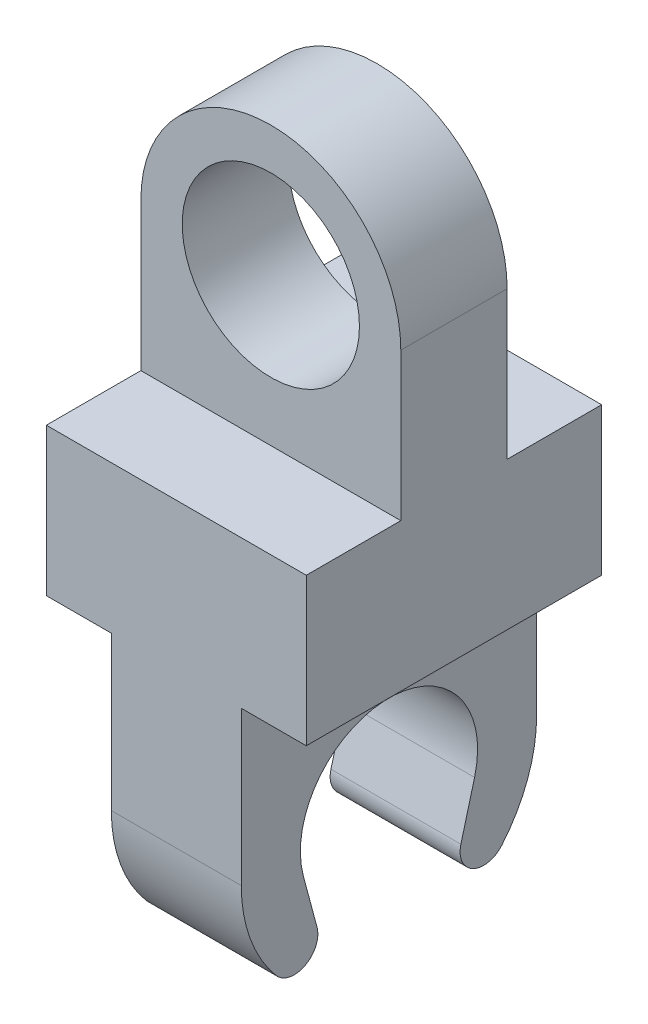
ISO-10303-21;
HEADER;
FILE_DESCRIPTION(('STEP AP214'),'2;1');
FILE_NAME('part.step','',(''),(''),'','','');
FILE_SCHEMA(('AUTOMOTIVE_DESIGN { 1 0 10303 214 1 1 1 1 }'));
ENDSEC;
DATA;
#1=APPLICATION_CONTEXT('core data for automotive mechanical design processes');
#2=APPLICATION_PROTOCOL_DEFINITION('international standard','automotive_design',2000,#1);
#3=PRODUCT_CONTEXT('',#1,'mechanical');
#4=PRODUCT('Part','Part','',(#3));
#5=PRODUCT_RELATED_PRODUCT_CATEGORY('part','',(#4));
#6=PRODUCT_DEFINITION_FORMATION('','',#4);
#7=PRODUCT_DEFINITION_CONTEXT('part definition',#1,'design');
#8=PRODUCT_DEFINITION('design','',#6,#7);
#9=PRODUCT_DEFINITION_SHAPE('','',#8);
#10=(LENGTH_UNIT() NAMED_UNIT(*) SI_UNIT(.MILLI.,.METRE.));
#11=(NAMED_UNIT(*) PLANE_ANGLE_UNIT() SI_UNIT($,.RADIAN.));
#12=(NAMED_UNIT(*) SI_UNIT($,.STERADIAN.) SOLID_ANGLE_UNIT());
#13=UNCERTAINTY_MEASURE_WITH_UNIT(LENGTH_MEASURE(1.E-05),#10,'distance_accuracy_value','');
#14=(GEOMETRIC_REPRESENTATION_CONTEXT(3) GLOBAL_UNCERTAINTY_ASSIGNED_CONTEXT((#13)) GLOBAL_UNIT_ASSIGNED_CONTEXT((#10,
#11,#12)) REPRESENTATION_CONTEXT('',''));
#15=CARTESIAN_POINT('',(0.,0.,0.));
#16=DIRECTION('',(0.,0.,1.));
#17=DIRECTION('',(1.,0.,0.));
#18=AXIS2_PLACEMENT_3D('',#15,#16,#17);
#19=CARTESIAN_POINT('',(22.,-25.,0.));
#20=DIRECTION('',(0.,1.,0.));
#21=DIRECTION('',(0.,0.,1.));
#22=AXIS2_PLACEMENT_3D('',#19,#20,#21);
#23=PLANE('',#22);
#24=DIRECTION('',(0.,0.,1.));
#25=VECTOR('',#24,1.);
#26=CARTESIAN_POINT('',(11.,-25.,25.));
#27=LINE('',#26,#25);
#28=CARTESIAN_POINT('',(11.,-25.,-25.));
#29=VERTEX_POINT('',#28);
#30=CARTESIAN_POINT('',(11.,-25.,25.));
#31=VERTEX_POINT('',#30);
#32=EDGE_CURVE('E234',#29,#31,#27,.T.);
#33=ORIENTED_EDGE('',*,*,#32,.F.);
#34=DIRECTION('',(-1.,0.,0.));
#35=VECTOR('',#34,1.);
#36=CARTESIAN_POINT('',(22.,-25.,-25.));
#37=LINE('',#36,#35);
#38=CARTESIAN_POINT('',(22.,-25.,-25.));
#39=VERTEX_POINT('',#38);
#40=EDGE_CURVE('E219',#39,#29,#37,.T.);
#41=ORIENTED_EDGE('',*,*,#40,.F.);
#42=DIRECTION('',(0.,0.,-1.));
#43=VECTOR('',#42,1.);
#44=CARTESIAN_POINT('',(22.,-25.,0.));
#45=LINE('',#44,#43);
#46=CARTESIAN_POINT('',(22.,-25.,25.));
#47=VERTEX_POINT('',#46);
#48=EDGE_CURVE('E278',#47,#39,#45,.T.);
#49=ORIENTED_EDGE('',*,*,#48,.F.);
#50=DIRECTION('',(-1.,0.,0.));
#51=VECTOR('',#50,1.);
#52=CARTESIAN_POINT('',(22.,-25.,25.));
#53=LINE('',#52,#51);
#54=EDGE_CURVE('E286',#47,#31,#53,.T.);
#55=ORIENTED_EDGE('',*,*,#54,.T.);
#56=EDGE_LOOP('',(#33,#41,#49,#55));
#57=FACE_BOUND('',#56,.T.);
#58=ADVANCED_FACE('F45',(#57),#23,.F.);
#59=CARTESIAN_POINT('',(22.,0.,9.));
#60=DIRECTION('',(-1.,0.,0.));
#61=DIRECTION('',(0.,0.,1.));
#62=AXIS2_PLACEMENT_3D('',#59,#60,#61);
#63=PLANE('',#62);
#64=ORIENTED_EDGE('',*,*,#48,.T.);
#65=DIRECTION('',(0.,-1.,0.));
#66=VECTOR('',#65,1.);
#67=CARTESIAN_POINT('',(22.,0.,-25.));
#68=LINE('',#67,#66);
#69=CARTESIAN_POINT('',(22.,0.,-25.));
#70=VERTEX_POINT('',#69);
#71=EDGE_CURVE('E208',#70,#39,#68,.T.);
#72=ORIENTED_EDGE('',*,*,#71,.F.);
#73=DIRECTION('',(0.,0.,-1.));
#74=VECTOR('',#73,1.);
#75=CARTESIAN_POINT('',(22.,0.,0.));
#76=LINE('',#75,#74);
#77=CARTESIAN_POINT('',(22.,0.,-9.));
#78=VERTEX_POINT('',#77);
#79=EDGE_CURVE('E205',#78,#70,#76,.T.);
#80=ORIENTED_EDGE('',*,*,#79,.F.);
#81=DIRECTION('',(0.,1.,0.));
#82=VECTOR('',#81,1.);
#83=CARTESIAN_POINT('',(22.,0.,-9.));
#84=LINE('',#83,#82);
#85=CARTESIAN_POINT('',(22.,25.,-9.));
#86=VERTEX_POINT('',#85);
#87=EDGE_CURVE('E225',#78,#86,#84,.T.);
#88=ORIENTED_EDGE('',*,*,#87,.T.);
#89=DIRECTION('',(0.,0.,-1.));
#90=VECTOR('',#89,1.);
#91=CARTESIAN_POINT('',(22.,25.,9.));
#92=LINE('',#91,#90);
#93=CARTESIAN_POINT('',(22.,25.,9.));
#94=VERTEX_POINT('',#93);
#95=EDGE_CURVE('E11',#94,#86,#92,.T.);
#96=ORIENTED_EDGE('',*,*,#95,.F.);
#97=DIRECTION('',(0.,1.,0.));
#98=VECTOR('',#97,1.);
#99=CARTESIAN_POINT('',(22.,0.,9.));
#100=LINE('',#99,#98);
#101=CARTESIAN_POINT('',(22.,0.,9.));
#102=VERTEX_POINT('',#101);
#103=EDGE_CURVE('E295',#102,#94,#100,.T.);
#104=ORIENTED_EDGE('',*,*,#103,.F.);
#105=DIRECTION('',(0.,0.,1.));
#106=VECTOR('',#105,1.);
#107=CARTESIAN_POINT('',(22.,0.,0.));
#108=LINE('',#107,#106);
#109=CARTESIAN_POINT('',(22.,0.,25.));
#110=VERTEX_POINT('',#109);
#111=EDGE_CURVE('E273',#102,#110,#108,.T.);
#112=ORIENTED_EDGE('',*,*,#111,.T.);
#113=DIRECTION('',(0.,-1.,0.));
#114=VECTOR('',#113,1.);
#115=CARTESIAN_POINT('',(22.,0.,25.));
#116=LINE('',#115,#114);
#117=EDGE_CURVE('E275',#110,#47,#116,.T.);
#118=ORIENTED_EDGE('',*,*,#117,.T.);
#119=EDGE_LOOP('',(#64,#72,#80,#88,#96,#104,#112,#118));
#120=FACE_BOUND('',#119,.T.);
#121=ADVANCED_FACE('F47',(#120),#63,.F.);
#122=CARTESIAN_POINT('',(0.,25.,9.));
#123=DIRECTION('',(0.,0.,-1.));
#124=DIRECTION('',(-1.,0.,0.));
#125=AXIS2_PLACEMENT_3D('',#122,#123,#124);
#126=CYLINDRICAL_SURFACE('',#125,22.);
#127=ORIENTED_EDGE('',*,*,#95,.T.);
#128=CARTESIAN_POINT('',(0.,25.,-9.));
#129=DIRECTION('',(0.,0.,1.));
#130=DIRECTION('',(1.,0.,0.));
#131=AXIS2_PLACEMENT_3D('',#128,#129,#130);
#132=CIRCLE('',#131,22.);
#133=CARTESIAN_POINT('',(-22.,25.,-9.));
#134=VERTEX_POINT('',#133);
#135=EDGE_CURVE('E228',#86,#134,#132,.T.);
#136=ORIENTED_EDGE('',*,*,#135,.T.);
#137=DIRECTION('',(0.,0.,-1.));
#138=VECTOR('',#137,1.);
#139=CARTESIAN_POINT('',(-22.,25.,9.));
#140=LINE('',#139,#138);
#141=CARTESIAN_POINT('',(-22.,25.,9.));
#142=VERTEX_POINT('',#141);
#143=EDGE_CURVE('E54',#142,#134,#140,.T.);
#144=ORIENTED_EDGE('',*,*,#143,.F.);
#145=CARTESIAN_POINT('',(0.,25.,9.));
#146=DIRECTION('',(0.,0.,1.));
#147=DIRECTION('',(1.,0.,0.));
#148=AXIS2_PLACEMENT_3D('',#145,#146,#147);
#149=CIRCLE('',#148,22.);
#150=EDGE_CURVE('E69',#94,#142,#149,.T.);
#151=ORIENTED_EDGE('',*,*,#150,.F.);
#152=EDGE_LOOP('',(#127,#136,#144,#151));
#153=FACE_BOUND('',#152,.T.);
#154=ADVANCED_FACE('F311',(#153),#126,.T.);
#155=CARTESIAN_POINT('',(-22.,0.,9.));
#156=DIRECTION('',(1.,0.,0.));
#157=DIRECTION('',(0.,0.,-1.));
#158=AXIS2_PLACEMENT_3D('',#155,#156,#157);
#159=PLANE('',#158);
#160=ORIENTED_EDGE('',*,*,#143,.T.);
#161=DIRECTION('',(0.,-1.,0.));
#162=VECTOR('',#161,1.);
#163=CARTESIAN_POINT('',(-22.,0.,-9.));
#164=LINE('',#163,#162);
#165=CARTESIAN_POINT('',(-22.,0.,-9.));
#166=VERTEX_POINT('',#165);
#167=EDGE_CURVE('E231',#134,#166,#164,.T.);
#168=ORIENTED_EDGE('',*,*,#167,.T.);
#169=DIRECTION('',(0.,0.,-1.));
#170=VECTOR('',#169,1.);
#171=CARTESIAN_POINT('',(-22.,0.,0.));
#172=LINE('',#171,#170);
#173=CARTESIAN_POINT('',(-22.,0.,-25.));
#174=VERTEX_POINT('',#173);
#175=EDGE_CURVE('E213',#166,#174,#172,.T.);
#176=ORIENTED_EDGE('',*,*,#175,.T.);
#177=DIRECTION('',(0.,-1.,0.));
#178=VECTOR('',#177,1.);
#179=CARTESIAN_POINT('',(-22.,0.,-25.));
#180=LINE('',#179,#178);
#181=CARTESIAN_POINT('',(-22.,-25.,-25.));
#182=VERTEX_POINT('',#181);
#183=EDGE_CURVE('E209',#174,#182,#180,.T.);
#184=ORIENTED_EDGE('',*,*,#183,.T.);
#185=DIRECTION('',(0.,0.,-1.));
#186=VECTOR('',#185,1.);
#187=CARTESIAN_POINT('',(-22.,-25.,0.));
#188=LINE('',#187,#186);
#189=CARTESIAN_POINT('',(-22.,-25.,25.));
#190=VERTEX_POINT('',#189);
#191=EDGE_CURVE('E276',#190,#182,#188,.T.);
#192=ORIENTED_EDGE('',*,*,#191,.F.);
#193=DIRECTION('',(0.,-1.,0.));
#194=VECTOR('',#193,1.);
#195=CARTESIAN_POINT('',(-22.,0.,25.));
#196=LINE('',#195,#194);
#197=CARTESIAN_POINT('',(-22.,0.,25.));
#198=VERTEX_POINT('',#197);
#199=EDGE_CURVE('E282',#198,#190,#196,.T.);
#200=ORIENTED_EDGE('',*,*,#199,.F.);
#201=DIRECTION('',(0.,0.,1.));
#202=VECTOR('',#201,1.);
#203=CARTESIAN_POINT('',(-22.,0.,0.));
#204=LINE('',#203,#202);
#205=CARTESIAN_POINT('',(-22.,0.,9.));
#206=VERTEX_POINT('',#205);
#207=EDGE_CURVE('E267',#206,#198,#204,.T.);
#208=ORIENTED_EDGE('',*,*,#207,.F.);
#209=DIRECTION('',(0.,-1.,0.));
#210=VECTOR('',#209,1.);
#211=CARTESIAN_POINT('',(-22.,0.,9.));
#212=LINE('',#211,#210);
#213=EDGE_CURVE('E298',#142,#206,#212,.T.);
#214=ORIENTED_EDGE('',*,*,#213,.F.);
#215=EDGE_LOOP('',(#160,#168,#176,#184,#192,#200,#208,#214));
#216=FACE_BOUND('',#215,.T.);
#217=ADVANCED_FACE('F303',(#216),#159,.F.);
#218=CARTESIAN_POINT('',(0.,25.,9.));
#219=DIRECTION('',(0.,0.,1.));
#220=DIRECTION('',(1.,0.,0.));
#221=AXIS2_PLACEMENT_3D('',#218,#219,#220);
#222=PLANE('',#221);
#223=CARTESIAN_POINT('',(0.,25.,9.));
#224=DIRECTION('',(0.,0.,1.));
#225=DIRECTION('',(1.,0.,0.));
#226=AXIS2_PLACEMENT_3D('',#223,#224,#225);
#227=CIRCLE('',#226,15.);
#228=CARTESIAN_POINT('',(15.,25.,9.));
#229=VERTEX_POINT('',#228);
#230=EDGE_CURVE('E343',#229,#229,#227,.T.);
#231=ORIENTED_EDGE('',*,*,#230,.F.);
#232=EDGE_LOOP('',(#231));
#233=FACE_BOUND('',#232,.T.);
#234=ORIENTED_EDGE('',*,*,#103,.T.);
#235=ORIENTED_EDGE('',*,*,#150,.T.);
#236=ORIENTED_EDGE('',*,*,#213,.T.);
#237=DIRECTION('',(1.,0.,0.));
#238=VECTOR('',#237,1.);
#239=CARTESIAN_POINT('',(-22.,0.,9.));
#240=LINE('',#239,#238);
#241=EDGE_CURVE('E292',#206,#102,#240,.T.);
#242=ORIENTED_EDGE('',*,*,#241,.T.);
#243=EDGE_LOOP('',(#234,#235,#236,#242));
#244=FACE_BOUND('',#243,.T.);
#245=ADVANCED_FACE('F329',(#233,#244),#222,.T.);
#246=CARTESIAN_POINT('',(22.,0.,0.));
#247=DIRECTION('',(0.,-1.,0.));
#248=DIRECTION('',(0.,0.,-1.));
#249=AXIS2_PLACEMENT_3D('',#246,#247,#248);
#250=PLANE('',#249);
#251=ORIENTED_EDGE('',*,*,#207,.T.);
#252=DIRECTION('',(-1.,0.,0.));
#253=VECTOR('',#252,1.);
#254=CARTESIAN_POINT('',(22.,0.,25.));
#255=LINE('',#254,#253);
#256=EDGE_CURVE('E289',#110,#198,#255,.T.);
#257=ORIENTED_EDGE('',*,*,#256,.F.);
#258=ORIENTED_EDGE('',*,*,#111,.F.);
#259=ORIENTED_EDGE('',*,*,#241,.F.);
#260=EDGE_LOOP('',(#251,#257,#258,#259));
#261=FACE_BOUND('',#260,.T.);
#262=ADVANCED_FACE('F330',(#261),#250,.F.);
#263=CARTESIAN_POINT('',(22.,0.,25.));
#264=DIRECTION('',(0.,0.,-1.));
#265=DIRECTION('',(0.,1.,0.));
#266=AXIS2_PLACEMENT_3D('',#263,#264,#265);
#267=PLANE('',#266);
#268=ORIENTED_EDGE('',*,*,#199,.T.);
#269=CARTESIAN_POINT('',(-11.,-25.,25.));
#270=VERTEX_POINT('',#269);
#271=EDGE_CURVE('E280',#270,#190,#53,.T.);
#272=ORIENTED_EDGE('',*,*,#271,.F.);
#273=DIRECTION('',(0.,-1.,0.));
#274=VECTOR('',#273,1.);
#275=CARTESIAN_POINT('',(-11.,-25.,25.));
#276=LINE('',#275,#274);
#277=CARTESIAN_POINT('',(-11.,-51.,25.));
#278=VERTEX_POINT('',#277);
#279=EDGE_CURVE('E61',#270,#278,#276,.T.);
#280=ORIENTED_EDGE('',*,*,#279,.T.);
#281=DIRECTION('',(1.,0.,0.));
#282=VECTOR('',#281,1.);
#283=CARTESIAN_POINT('',(-11.,-51.,25.));
#284=LINE('',#283,#282);
#285=CARTESIAN_POINT('',(11.,-51.,25.));
#286=VERTEX_POINT('',#285);
#287=EDGE_CURVE('E249',#278,#286,#284,.T.);
#288=ORIENTED_EDGE('',*,*,#287,.T.);
#289=DIRECTION('',(0.,-1.,0.));
#290=VECTOR('',#289,1.);
#291=CARTESIAN_POINT('',(11.,-25.,25.));
#292=LINE('',#291,#290);
#293=EDGE_CURVE('E252',#31,#286,#292,.T.);
#294=ORIENTED_EDGE('',*,*,#293,.F.);
#295=ORIENTED_EDGE('',*,*,#54,.F.);
#296=ORIENTED_EDGE('',*,*,#117,.F.);
#297=ORIENTED_EDGE('',*,*,#256,.T.);
#298=EDGE_LOOP('',(#268,#272,#280,#288,#294,#295,#296,#297));
#299=FACE_BOUND('',#298,.T.);
#300=ADVANCED_FACE('F325',(#299),#267,.F.);
#301=ORIENTED_EDGE('',*,*,#191,.T.);
#302=CARTESIAN_POINT('',(-11.,-25.,-25.));
#303=VERTEX_POINT('',#302);
#304=EDGE_CURVE('E212',#303,#182,#37,.T.);
#305=ORIENTED_EDGE('',*,*,#304,.F.);
#306=DIRECTION('',(0.,0.,1.));
#307=VECTOR('',#306,1.);
#308=CARTESIAN_POINT('',(-11.,-25.,25.));
#309=LINE('',#308,#307);
#310=EDGE_CURVE('E186',#303,#270,#309,.T.);
#311=ORIENTED_EDGE('',*,*,#310,.T.);
#312=ORIENTED_EDGE('',*,*,#271,.T.);
#313=EDGE_LOOP('',(#301,#305,#311,#312));
#314=FACE_BOUND('',#313,.T.);
#315=ADVANCED_FACE('F322',(#314),#23,.F.);
#316=CARTESIAN_POINT('',(-11.,-51.,0.));
#317=DIRECTION('',(1.,0.,0.));
#318=DIRECTION('',(0.,0.,-1.));
#319=AXIS2_PLACEMENT_3D('',#316,#317,#318);
#320=CYLINDRICAL_SURFACE('',#319,15.);
#321=CARTESIAN_POINT('',(11.,-51.,0.));
#322=DIRECTION('',(-1.,0.,0.));
#323=DIRECTION('',(0.,0.,1.));
#324=AXIS2_PLACEMENT_3D('',#321,#322,#323);
#325=CIRCLE('',#324,15.);
#326=CARTESIAN_POINT('',(11.,-54.8822856765378,14.488887394336));
#327=VERTEX_POINT('',#326);
#328=CARTESIAN_POINT('',(11.,-54.8822856765378,-14.488887394336));
#329=VERTEX_POINT('',#328);
#330=EDGE_CURVE('E236',#327,#329,#325,.T.);
#331=ORIENTED_EDGE('',*,*,#330,.F.);
#332=DIRECTION('',(1.,0.,0.));
#333=VECTOR('',#332,1.);
#334=CARTESIAN_POINT('',(-11.,-54.8822856765378,14.488887394336));
#335=LINE('',#334,#333);
#336=CARTESIAN_POINT('',(-11.,-54.8822856765378,14.488887394336));
#337=VERTEX_POINT('',#336);
#338=EDGE_CURVE('E265',#337,#327,#335,.T.);
#339=ORIENTED_EDGE('',*,*,#338,.F.);
#340=CARTESIAN_POINT('',(-11.,-51.,0.));
#341=DIRECTION('',(-1.,0.,0.));
#342=DIRECTION('',(0.,0.,1.));
#343=AXIS2_PLACEMENT_3D('',#340,#341,#342);
#344=CIRCLE('',#343,15.);
#345=CARTESIAN_POINT('',(-11.,-54.8822856765378,-14.488887394336));
#346=VERTEX_POINT('',#345);
#347=EDGE_CURVE('E247',#337,#346,#344,.T.);
#348=ORIENTED_EDGE('',*,*,#347,.T.);
#349=DIRECTION('',(1.,0.,0.));
#350=VECTOR('',#349,1.);
#351=CARTESIAN_POINT('',(-11.,-54.8822856765378,-14.488887394336));
#352=LINE('',#351,#350);
#353=EDGE_CURVE('E216',#346,#329,#352,.T.);
#354=ORIENTED_EDGE('',*,*,#353,.T.);
#355=EDGE_LOOP('',(#331,#339,#348,#354));
#356=FACE_BOUND('',#355,.T.);
#357=ADVANCED_FACE('F361',(#356),#320,.F.);
#358=CARTESIAN_POINT('',(-11.,-54.8822856765378,14.488887394336));
#359=DIRECTION('',(0.,0.258819045102521,-0.965925826289068));
#360=DIRECTION('',(0.,0.965925826289068,0.258819045102521));
#361=AXIS2_PLACEMENT_3D('',#358,#359,#360);
#362=PLANE('',#361);
#363=DIRECTION('',(0.,0.965925826289068,0.258819045102521));
#364=VECTOR('',#363,1.);
#365=CARTESIAN_POINT('',(11.,-54.8822856765378,14.488887394336));
#366=LINE('',#365,#364);
#367=CARTESIAN_POINT('',(11.,-63.5217889117579,12.1739394794527));
#368=VERTEX_POINT('',#367);
#369=EDGE_CURVE('E261',#368,#327,#366,.T.);
#370=ORIENTED_EDGE('',*,*,#369,.F.);
#371=DIRECTION('',(1.,0.,0.));
#372=VECTOR('',#371,1.);
#373=CARTESIAN_POINT('',(-11.,-63.5217889117579,12.1739394794527));
#374=LINE('',#373,#372);
#375=CARTESIAN_POINT('',(-11.,-63.5217889117579,12.1739394794527));
#376=VERTEX_POINT('',#375);
#377=EDGE_CURVE('E268',#376,#368,#374,.T.);
#378=ORIENTED_EDGE('',*,*,#377,.F.);
#379=DIRECTION('',(0.,0.965925826289068,0.258819045102521));
#380=VECTOR('',#379,1.);
#381=CARTESIAN_POINT('',(-11.,-54.8822856765378,14.488887394336));
#382=LINE('',#381,#380);
#383=EDGE_CURVE('E244',#376,#337,#382,.T.);
#384=ORIENTED_EDGE('',*,*,#383,.T.);
#385=ORIENTED_EDGE('',*,*,#338,.T.);
#386=EDGE_LOOP('',(#370,#378,#384,#385));
#387=FACE_BOUND('',#386,.T.);
#388=ADVANCED_FACE('F392',(#387),#362,.T.);
#389=CARTESIAN_POINT('',(-11.,-64.5570650921679,16.037642784609));
#390=DIRECTION('',(1.,0.,0.));
#391=DIRECTION('',(0.,0.,-1.));
#392=AXIS2_PLACEMENT_3D('',#389,#390,#391);
#393=CYLINDRICAL_SURFACE('',#392,4.);
#394=CARTESIAN_POINT('',(11.,-64.5570650921679,16.037642784609));
#395=DIRECTION('',(1.,0.,0.));
#396=DIRECTION('',(0.,0.,1.));
#397=AXIS2_PLACEMENT_3D('',#394,#395,#396);
#398=CIRCLE('',#397,4.);
#399=CARTESIAN_POINT('',(11.,-67.1393632049618,19.0924318864393));
#400=VERTEX_POINT('',#399);
#401=EDGE_CURVE('E258',#400,#368,#398,.T.);
#402=ORIENTED_EDGE('',*,*,#401,.F.);
#403=DIRECTION('',(1.,0.,0.));
#404=VECTOR('',#403,1.);
#405=CARTESIAN_POINT('',(-11.,-67.1393632049618,19.0924318864393));
#406=LINE('',#405,#404);
#407=CARTESIAN_POINT('',(-11.,-67.1393632049618,19.0924318864393));
#408=VERTEX_POINT('',#407);
#409=EDGE_CURVE('E270',#408,#400,#406,.T.);
#410=ORIENTED_EDGE('',*,*,#409,.F.);
#411=CARTESIAN_POINT('',(-11.,-64.5570650921679,16.037642784609));
#412=DIRECTION('',(1.,0.,0.));
#413=DIRECTION('',(0.,0.,1.));
#414=AXIS2_PLACEMENT_3D('',#411,#412,#413);
#415=CIRCLE('',#414,4.);
#416=EDGE_CURVE('E241',#408,#376,#415,.T.);
#417=ORIENTED_EDGE('',*,*,#416,.T.);
#418=ORIENTED_EDGE('',*,*,#377,.T.);
#419=EDGE_LOOP('',(#402,#410,#417,#418));
#420=FACE_BOUND('',#419,.T.);
#421=ADVANCED_FACE('F418',(#420),#393,.T.);
#422=CARTESIAN_POINT('',(-11.,-51.,0.));
#423=DIRECTION('',(1.,0.,0.));
#424=DIRECTION('',(0.,0.,-1.));
#425=AXIS2_PLACEMENT_3D('',#422,#423,#424);
#426=CYLINDRICAL_SURFACE('',#425,25.);
#427=CARTESIAN_POINT('',(11.,-51.,0.));
#428=DIRECTION('',(1.,0.,0.));
#429=DIRECTION('',(0.,0.,-1.));
#430=AXIS2_PLACEMENT_3D('',#427,#428,#429);
#431=CIRCLE('',#430,25.);
#432=EDGE_CURVE('E255',#286,#400,#431,.T.);
#433=ORIENTED_EDGE('',*,*,#432,.F.);
#434=ORIENTED_EDGE('',*,*,#287,.F.);
#435=CARTESIAN_POINT('',(-11.,-51.,0.));
#436=DIRECTION('',(1.,0.,0.));
#437=DIRECTION('',(0.,0.,-1.));
#438=AXIS2_PLACEMENT_3D('',#435,#436,#437);
#439=CIRCLE('',#438,25.);
#440=EDGE_CURVE('E238',#278,#408,#439,.T.);
#441=ORIENTED_EDGE('',*,*,#440,.T.);
#442=ORIENTED_EDGE('',*,*,#409,.T.);
#443=EDGE_LOOP('',(#433,#434,#441,#442));
#444=FACE_BOUND('',#443,.T.);
#445=ADVANCED_FACE('F427',(#444),#426,.T.);
#446=CARTESIAN_POINT('',(-11.,-51.,0.));
#447=DIRECTION('',(-1.,0.,0.));
#448=DIRECTION('',(0.,0.,1.));
#449=AXIS2_PLACEMENT_3D('',#446,#447,#448);
#450=PLANE('',#449);
#451=ORIENTED_EDGE('',*,*,#310,.F.);
#452=DIRECTION('',(0.,-1.,0.));
#453=VECTOR('',#452,1.);
#454=CARTESIAN_POINT('',(-11.,-25.,-25.));
#455=LINE('',#454,#453);
#456=CARTESIAN_POINT('',(-11.,-51.,-25.));
#457=VERTEX_POINT('',#456);
#458=EDGE_CURVE('E182',#303,#457,#455,.T.);
#459=ORIENTED_EDGE('',*,*,#458,.T.);
#460=CARTESIAN_POINT('',(-11.,-51.,0.));
#461=DIRECTION('',(-1.,0.,0.));
#462=DIRECTION('',(0.,0.,1.));
#463=AXIS2_PLACEMENT_3D('',#460,#461,#462);
#464=CIRCLE('',#463,25.);
#465=CARTESIAN_POINT('',(-11.,-67.1393632049618,-19.0924318864393));
#466=VERTEX_POINT('',#465);
#467=EDGE_CURVE('E172',#457,#466,#464,.T.);
#468=ORIENTED_EDGE('',*,*,#467,.T.);
#469=CARTESIAN_POINT('',(-11.,-64.5570650921679,-16.037642784609));
#470=DIRECTION('',(-1.,0.,0.));
#471=DIRECTION('',(0.,0.,-1.));
#472=AXIS2_PLACEMENT_3D('',#469,#470,#471);
#473=CIRCLE('',#472,4.);
#474=CARTESIAN_POINT('',(-11.,-63.5217889117579,-12.1739394794527));
#475=VERTEX_POINT('',#474);
#476=EDGE_CURVE('E181',#466,#475,#473,.T.);
#477=ORIENTED_EDGE('',*,*,#476,.T.);
#478=DIRECTION('',(0.,0.965925826289068,-0.258819045102521));
#479=VECTOR('',#478,1.);
#480=CARTESIAN_POINT('',(-11.,-54.8822856765378,-14.488887394336));
#481=LINE('',#480,#479);
#482=EDGE_CURVE('E197',#475,#346,#481,.T.);
#483=ORIENTED_EDGE('',*,*,#482,.T.);
#484=ORIENTED_EDGE('',*,*,#347,.F.);
#485=ORIENTED_EDGE('',*,*,#383,.F.);
#486=ORIENTED_EDGE('',*,*,#416,.F.);
#487=ORIENTED_EDGE('',*,*,#440,.F.);
#488=ORIENTED_EDGE('',*,*,#279,.F.);
#489=EDGE_LOOP('',(#451,#459,#468,#477,#483,#484,#485,#486,#487,#488));
#490=FACE_BOUND('',#489,.T.);
#491=ADVANCED_FACE('F185',(#490),#450,.T.);
#492=CARTESIAN_POINT('',(11.,-51.,0.));
#493=DIRECTION('',(-1.,0.,0.));
#494=DIRECTION('',(0.,0.,1.));
#495=AXIS2_PLACEMENT_3D('',#492,#493,#494);
#496=PLANE('',#495);
#497=ORIENTED_EDGE('',*,*,#32,.T.);
#498=ORIENTED_EDGE('',*,*,#293,.T.);
#499=ORIENTED_EDGE('',*,*,#432,.T.);
#500=ORIENTED_EDGE('',*,*,#401,.T.);
#501=ORIENTED_EDGE('',*,*,#369,.T.);
#502=ORIENTED_EDGE('',*,*,#330,.T.);
#503=DIRECTION('',(0.,0.965925826289068,-0.258819045102521));
#504=VECTOR('',#503,1.);
#505=CARTESIAN_POINT('',(11.,-54.8822856765378,-14.488887394336));
#506=LINE('',#505,#504);
#507=CARTESIAN_POINT('',(11.,-63.5217889117579,-12.1739394794527));
#508=VERTEX_POINT('',#507);
#509=EDGE_CURVE('E190',#508,#329,#506,.T.);
#510=ORIENTED_EDGE('',*,*,#509,.F.);
#511=CARTESIAN_POINT('',(11.,-64.5570650921679,-16.037642784609));
#512=DIRECTION('',(-1.,0.,0.));
#513=DIRECTION('',(0.,0.,-1.));
#514=AXIS2_PLACEMENT_3D('',#511,#512,#513);
#515=CIRCLE('',#514,4.);
#516=CARTESIAN_POINT('',(11.,-67.1393632049618,-19.0924318864393));
#517=VERTEX_POINT('',#516);
#518=EDGE_CURVE('E340',#517,#508,#515,.T.);
#519=ORIENTED_EDGE('',*,*,#518,.F.);
#520=CARTESIAN_POINT('',(11.,-51.,0.));
#521=DIRECTION('',(-1.,0.,0.));
#522=DIRECTION('',(0.,0.,1.));
#523=AXIS2_PLACEMENT_3D('',#520,#521,#522);
#524=CIRCLE('',#523,25.);
#525=CARTESIAN_POINT('',(11.,-51.,-25.));
#526=VERTEX_POINT('',#525);
#527=EDGE_CURVE('E338',#526,#517,#524,.T.);
#528=ORIENTED_EDGE('',*,*,#527,.F.);
#529=DIRECTION('',(0.,-1.,0.));
#530=VECTOR('',#529,1.);
#531=CARTESIAN_POINT('',(11.,-25.,-25.));
#532=LINE('',#531,#530);
#533=EDGE_CURVE('E196',#29,#526,#532,.T.);
#534=ORIENTED_EDGE('',*,*,#533,.F.);
#535=EDGE_LOOP('',(#497,#498,#499,#500,#501,#502,#510,#519,#528,#534));
#536=FACE_BOUND('',#535,.T.);
#537=ADVANCED_FACE('F336',(#536),#496,.F.);
#538=CARTESIAN_POINT('',(0.,25.,-9.));
#539=DIRECTION('',(0.,0.,-1.));
#540=DIRECTION('',(1.,0.,0.));
#541=AXIS2_PLACEMENT_3D('',#538,#539,#540);
#542=PLANE('',#541);
#543=CARTESIAN_POINT('',(0.,25.,-9.));
#544=DIRECTION('',(0.,0.,-1.));
#545=DIRECTION('',(-1.,0.,0.));
#546=AXIS2_PLACEMENT_3D('',#543,#544,#545);
#547=CIRCLE('',#546,15.);
#548=CARTESIAN_POINT('',(-15.,25.,-9.));
#549=VERTEX_POINT('',#548);
#550=EDGE_CURVE('E49',#549,#549,#547,.T.);
#551=ORIENTED_EDGE('',*,*,#550,.F.);
#552=EDGE_LOOP('',(#551));
#553=FACE_BOUND('',#552,.T.);
#554=ORIENTED_EDGE('',*,*,#87,.F.);
#555=DIRECTION('',(1.,0.,0.));
#556=VECTOR('',#555,1.);
#557=CARTESIAN_POINT('',(-22.,0.,-9.));
#558=LINE('',#557,#556);
#559=EDGE_CURVE('E223',#166,#78,#558,.T.);
#560=ORIENTED_EDGE('',*,*,#559,.F.);
#561=ORIENTED_EDGE('',*,*,#167,.F.);
#562=ORIENTED_EDGE('',*,*,#135,.F.);
#563=EDGE_LOOP('',(#554,#560,#561,#562));
#564=FACE_BOUND('',#563,.T.);
#565=ADVANCED_FACE('F309',(#553,#564),#542,.T.);
#566=CARTESIAN_POINT('',(22.,0.,0.));
#567=DIRECTION('',(0.,-1.,0.));
#568=DIRECTION('',(0.,0.,1.));
#569=AXIS2_PLACEMENT_3D('',#566,#567,#568);
#570=PLANE('',#569);
#571=ORIENTED_EDGE('',*,*,#175,.F.);
#572=ORIENTED_EDGE('',*,*,#559,.T.);
#573=ORIENTED_EDGE('',*,*,#79,.T.);
#574=DIRECTION('',(-1.,0.,0.));
#575=VECTOR('',#574,1.);
#576=CARTESIAN_POINT('',(22.,0.,-25.));
#577=LINE('',#576,#575);
#578=EDGE_CURVE('E221',#70,#174,#577,.T.);
#579=ORIENTED_EDGE('',*,*,#578,.T.);
#580=EDGE_LOOP('',(#571,#572,#573,#579));
#581=FACE_BOUND('',#580,.T.);
#582=ADVANCED_FACE('F318',(#581),#570,.F.);
#583=CARTESIAN_POINT('',(22.,0.,-25.));
#584=DIRECTION('',(0.,0.,1.));
#585=DIRECTION('',(0.,1.,0.));
#586=AXIS2_PLACEMENT_3D('',#583,#584,#585);
#587=PLANE('',#586);
#588=ORIENTED_EDGE('',*,*,#183,.F.);
#589=ORIENTED_EDGE('',*,*,#578,.F.);
#590=ORIENTED_EDGE('',*,*,#71,.T.);
#591=ORIENTED_EDGE('',*,*,#40,.T.);
#592=ORIENTED_EDGE('',*,*,#533,.T.);
#593=DIRECTION('',(1.,0.,0.));
#594=VECTOR('',#593,1.);
#595=CARTESIAN_POINT('',(-11.,-51.,-25.));
#596=LINE('',#595,#594);
#597=EDGE_CURVE('E176',#457,#526,#596,.T.);
#598=ORIENTED_EDGE('',*,*,#597,.F.);
#599=ORIENTED_EDGE('',*,*,#458,.F.);
#600=ORIENTED_EDGE('',*,*,#304,.T.);
#601=EDGE_LOOP('',(#588,#589,#590,#591,#592,#598,#599,#600));
#602=FACE_BOUND('',#601,.T.);
#603=ADVANCED_FACE('F193',(#602),#587,.F.);
#604=CARTESIAN_POINT('',(-11.,-54.8822856765378,-14.488887394336));
#605=DIRECTION('',(0.,0.258819045102521,0.965925826289068));
#606=DIRECTION('',(0.,0.965925826289068,-0.258819045102521));
#607=AXIS2_PLACEMENT_3D('',#604,#605,#606);
#608=PLANE('',#607);
#609=ORIENTED_EDGE('',*,*,#509,.T.);
#610=ORIENTED_EDGE('',*,*,#353,.F.);
#611=ORIENTED_EDGE('',*,*,#482,.F.);
#612=DIRECTION('',(1.,0.,0.));
#613=VECTOR('',#612,1.);
#614=CARTESIAN_POINT('',(-11.,-63.5217889117579,-12.1739394794527));
#615=LINE('',#614,#613);
#616=EDGE_CURVE('E199',#475,#508,#615,.T.);
#617=ORIENTED_EDGE('',*,*,#616,.T.);
#618=EDGE_LOOP('',(#609,#610,#611,#617));
#619=FACE_BOUND('',#618,.T.);
#620=ADVANCED_FACE('F355',(#619),#608,.T.);
#621=CARTESIAN_POINT('',(-11.,-64.5570650921679,-16.037642784609));
#622=DIRECTION('',(1.,0.,0.));
#623=DIRECTION('',(0.,0.,1.));
#624=AXIS2_PLACEMENT_3D('',#621,#622,#623);
#625=CYLINDRICAL_SURFACE('',#624,4.);
#626=ORIENTED_EDGE('',*,*,#518,.T.);
#627=ORIENTED_EDGE('',*,*,#616,.F.);
#628=ORIENTED_EDGE('',*,*,#476,.F.);
#629=DIRECTION('',(1.,0.,0.));
#630=VECTOR('',#629,1.);
#631=CARTESIAN_POINT('',(-11.,-67.1393632049618,-19.0924318864393));
#632=LINE('',#631,#630);
#633=EDGE_CURVE('E179',#466,#517,#632,.T.);
#634=ORIENTED_EDGE('',*,*,#633,.T.);
#635=EDGE_LOOP('',(#626,#627,#628,#634));
#636=FACE_BOUND('',#635,.T.);
#637=ADVANCED_FACE('F485',(#636),#625,.T.);
#638=CARTESIAN_POINT('',(-11.,-51.,0.));
#639=DIRECTION('',(1.,0.,0.));
#640=DIRECTION('',(0.,0.,1.));
#641=AXIS2_PLACEMENT_3D('',#638,#639,#640);
#642=CYLINDRICAL_SURFACE('',#641,25.);
#643=ORIENTED_EDGE('',*,*,#527,.T.);
#644=ORIENTED_EDGE('',*,*,#633,.F.);
#645=ORIENTED_EDGE('',*,*,#467,.F.);
#646=ORIENTED_EDGE('',*,*,#597,.T.);
#647=EDGE_LOOP('',(#643,#644,#645,#646));
#648=FACE_BOUND('',#647,.T.);
#649=ADVANCED_FACE('F174',(#648),#642,.T.);
#650=CARTESIAN_POINT('',(0.,25.,-35.));
#651=DIRECTION('',(0.,0.,1.));
#652=DIRECTION('',(1.,0.,0.));
#653=AXIS2_PLACEMENT_3D('',#650,#651,#652);
#654=CYLINDRICAL_SURFACE('',#653,15.);
#655=ORIENTED_EDGE('',*,*,#550,.T.);
#656=EDGE_LOOP('',(#655));
#657=FACE_BOUND('',#656,.T.);
#658=ORIENTED_EDGE('',*,*,#230,.T.);
#659=EDGE_LOOP('',(#658));
#660=FACE_BOUND('',#659,.T.);
#661=ADVANCED_FACE('F368',(#657,#660),#654,.F.);
#662=CLOSED_SHELL('',(#58,#121,#154,#217,#245,#262,#300,#315,#357,#388,#421,#445,#491,#537,#565,
#582,#603,#620,#637,#649,#661));
#663=MANIFOLD_SOLID_BREP('B2',#662);
#664=ADVANCED_BREP_SHAPE_REPRESENTATION('',(#18,#663),#14);
#665=SHAPE_DEFINITION_REPRESENTATION(#9,#664);
ENDSEC;
END-ISO-10303-21;
